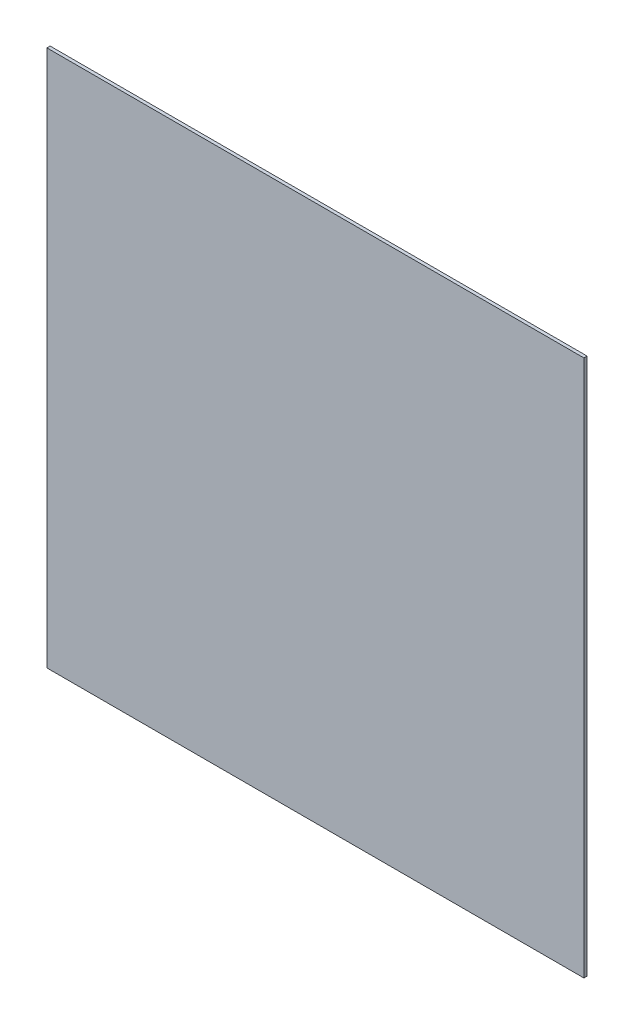
ISO-10303-21;
HEADER;
FILE_DESCRIPTION(('STEP AP214'),'2;1');
FILE_NAME('part.step','',(''),(''),'','','');
FILE_SCHEMA(('AUTOMOTIVE_DESIGN { 1 0 10303 214 1 1 1 1 }'));
ENDSEC;
DATA;
#1=APPLICATION_CONTEXT('core data for automotive mechanical design processes');
#2=APPLICATION_PROTOCOL_DEFINITION('international standard','automotive_design',2000,#1);
#3=PRODUCT_CONTEXT('',#1,'mechanical');
#4=PRODUCT('Part','Part','',(#3));
#5=PRODUCT_RELATED_PRODUCT_CATEGORY('part','',(#4));
#6=PRODUCT_DEFINITION_FORMATION('','',#4);
#7=PRODUCT_DEFINITION_CONTEXT('part definition',#1,'design');
#8=PRODUCT_DEFINITION('design','',#6,#7);
#9=PRODUCT_DEFINITION_SHAPE('','',#8);
#10=(LENGTH_UNIT() NAMED_UNIT(*) SI_UNIT(.MILLI.,.METRE.));
#11=(NAMED_UNIT(*) PLANE_ANGLE_UNIT() SI_UNIT($,.RADIAN.));
#12=(NAMED_UNIT(*) SI_UNIT($,.STERADIAN.) SOLID_ANGLE_UNIT());
#13=UNCERTAINTY_MEASURE_WITH_UNIT(LENGTH_MEASURE(1.E-05),#10,'distance_accuracy_value','');
#14=(GEOMETRIC_REPRESENTATION_CONTEXT(3) GLOBAL_UNCERTAINTY_ASSIGNED_CONTEXT((#13)) GLOBAL_UNIT_ASSIGNED_CONTEXT((#10,
#11,#12)) REPRESENTATION_CONTEXT('',''));
#15=CARTESIAN_POINT('',(0.,0.,0.));
#16=DIRECTION('',(0.,0.,1.));
#17=DIRECTION('',(1.,0.,0.));
#18=AXIS2_PLACEMENT_3D('',#15,#16,#17);
#19=CARTESIAN_POINT('',(500.,500.,3.));
#20=DIRECTION('',(-1.,0.,0.));
#21=DIRECTION('',(0.,-1.,0.));
#22=AXIS2_PLACEMENT_3D('',#19,#20,#21);
#23=PLANE('',#22);
#24=DIRECTION('',(0.,1.,0.));
#25=VECTOR('',#24,1.);
#26=CARTESIAN_POINT('',(500.,500.,-3.));
#27=LINE('',#26,#25);
#28=CARTESIAN_POINT('',(500.,-500.,-3.));
#29=VERTEX_POINT('',#28);
#30=CARTESIAN_POINT('',(500.,500.,-3.));
#31=VERTEX_POINT('',#30);
#32=EDGE_CURVE('E96',#29,#31,#27,.T.);
#33=ORIENTED_EDGE('',*,*,#32,.T.);
#34=DIRECTION('',(0.,0.,-1.));
#35=VECTOR('',#34,1.);
#36=CARTESIAN_POINT('',(500.,500.,3.));
#37=LINE('',#36,#35);
#38=CARTESIAN_POINT('',(500.,500.,3.));
#39=VERTEX_POINT('',#38);
#40=EDGE_CURVE('E11',#39,#31,#37,.T.);
#41=ORIENTED_EDGE('',*,*,#40,.F.);
#42=DIRECTION('',(0.,1.,0.));
#43=VECTOR('',#42,1.);
#44=CARTESIAN_POINT('',(500.,500.,3.));
#45=LINE('',#44,#43);
#46=CARTESIAN_POINT('',(500.,-500.,3.));
#47=VERTEX_POINT('',#46);
#48=EDGE_CURVE('E84',#47,#39,#45,.T.);
#49=ORIENTED_EDGE('',*,*,#48,.F.);
#50=DIRECTION('',(0.,0.,-1.));
#51=VECTOR('',#50,1.);
#52=CARTESIAN_POINT('',(500.,-500.,3.));
#53=LINE('',#52,#51);
#54=EDGE_CURVE('E92',#47,#29,#53,.T.);
#55=ORIENTED_EDGE('',*,*,#54,.T.);
#56=EDGE_LOOP('',(#33,#41,#49,#55));
#57=FACE_BOUND('',#56,.T.);
#58=ADVANCED_FACE('F33',(#57),#23,.F.);
#59=CARTESIAN_POINT('',(-500.,500.,3.));
#60=DIRECTION('',(0.,-1.,0.));
#61=DIRECTION('',(0.,0.,-1.));
#62=AXIS2_PLACEMENT_3D('',#59,#60,#61);
#63=PLANE('',#62);
#64=DIRECTION('',(-1.,0.,0.));
#65=VECTOR('',#64,1.);
#66=CARTESIAN_POINT('',(-500.,500.,-3.));
#67=LINE('',#66,#65);
#68=CARTESIAN_POINT('',(-500.,500.,-3.));
#69=VERTEX_POINT('',#68);
#70=EDGE_CURVE('E88',#31,#69,#67,.T.);
#71=ORIENTED_EDGE('',*,*,#70,.T.);
#72=DIRECTION('',(0.,0.,-1.));
#73=VECTOR('',#72,1.);
#74=CARTESIAN_POINT('',(-500.,500.,3.));
#75=LINE('',#74,#73);
#76=CARTESIAN_POINT('',(-500.,500.,3.));
#77=VERTEX_POINT('',#76);
#78=EDGE_CURVE('E41',#77,#69,#75,.T.);
#79=ORIENTED_EDGE('',*,*,#78,.F.);
#80=DIRECTION('',(-1.,0.,0.));
#81=VECTOR('',#80,1.);
#82=CARTESIAN_POINT('',(-500.,500.,3.));
#83=LINE('',#82,#81);
#84=EDGE_CURVE('E79',#39,#77,#83,.T.);
#85=ORIENTED_EDGE('',*,*,#84,.F.);
#86=ORIENTED_EDGE('',*,*,#40,.T.);
#87=EDGE_LOOP('',(#71,#79,#85,#86));
#88=FACE_BOUND('',#87,.T.);
#89=ADVANCED_FACE('F87',(#88),#63,.F.);
#90=CARTESIAN_POINT('',(-500.,500.,3.));
#91=DIRECTION('',(1.,0.,0.));
#92=DIRECTION('',(0.,0.,-1.));
#93=AXIS2_PLACEMENT_3D('',#90,#91,#92);
#94=PLANE('',#93);
#95=DIRECTION('',(0.,-1.,0.));
#96=VECTOR('',#95,1.);
#97=CARTESIAN_POINT('',(-500.,500.,-3.));
#98=LINE('',#97,#96);
#99=CARTESIAN_POINT('',(-500.,-500.,-3.));
#100=VERTEX_POINT('',#99);
#101=EDGE_CURVE('E66',#69,#100,#98,.T.);
#102=ORIENTED_EDGE('',*,*,#101,.T.);
#103=DIRECTION('',(0.,0.,-1.));
#104=VECTOR('',#103,1.);
#105=CARTESIAN_POINT('',(-500.,-500.,3.));
#106=LINE('',#105,#104);
#107=CARTESIAN_POINT('',(-500.,-500.,3.));
#108=VERTEX_POINT('',#107);
#109=EDGE_CURVE('E89',#108,#100,#106,.T.);
#110=ORIENTED_EDGE('',*,*,#109,.F.);
#111=DIRECTION('',(0.,-1.,0.));
#112=VECTOR('',#111,1.);
#113=CARTESIAN_POINT('',(-500.,500.,3.));
#114=LINE('',#113,#112);
#115=EDGE_CURVE('E82',#77,#108,#114,.T.);
#116=ORIENTED_EDGE('',*,*,#115,.F.);
#117=ORIENTED_EDGE('',*,*,#78,.T.);
#118=EDGE_LOOP('',(#102,#110,#116,#117));
#119=FACE_BOUND('',#118,.T.);
#120=ADVANCED_FACE('F90',(#119),#94,.F.);
#121=CARTESIAN_POINT('',(-500.,-500.,3.));
#122=DIRECTION('',(0.,1.,0.));
#123=DIRECTION('',(0.,0.,1.));
#124=AXIS2_PLACEMENT_3D('',#121,#122,#123);
#125=PLANE('',#124);
#126=DIRECTION('',(1.,0.,0.));
#127=VECTOR('',#126,1.);
#128=CARTESIAN_POINT('',(-500.,-500.,-3.));
#129=LINE('',#128,#127);
#130=EDGE_CURVE('E72',#100,#29,#129,.T.);
#131=ORIENTED_EDGE('',*,*,#130,.T.);
#132=ORIENTED_EDGE('',*,*,#54,.F.);
#133=DIRECTION('',(1.,0.,0.));
#134=VECTOR('',#133,1.);
#135=CARTESIAN_POINT('',(-500.,-500.,3.));
#136=LINE('',#135,#134);
#137=EDGE_CURVE('E49',#108,#47,#136,.T.);
#138=ORIENTED_EDGE('',*,*,#137,.F.);
#139=ORIENTED_EDGE('',*,*,#109,.T.);
#140=EDGE_LOOP('',(#131,#132,#138,#139));
#141=FACE_BOUND('',#140,.T.);
#142=ADVANCED_FACE('F103',(#141),#125,.F.);
#143=CARTESIAN_POINT('',(0.,0.,3.));
#144=DIRECTION('',(0.,0.,1.));
#145=DIRECTION('',(1.,0.,0.));
#146=AXIS2_PLACEMENT_3D('',#143,#144,#145);
#147=PLANE('',#146);
#148=ORIENTED_EDGE('',*,*,#48,.T.);
#149=ORIENTED_EDGE('',*,*,#84,.T.);
#150=ORIENTED_EDGE('',*,*,#115,.T.);
#151=ORIENTED_EDGE('',*,*,#137,.T.);
#152=EDGE_LOOP('',(#148,#149,#150,#151));
#153=FACE_BOUND('',#152,.T.);
#154=ADVANCED_FACE('F80',(#153),#147,.T.);
#155=CARTESIAN_POINT('',(0.,0.,-3.));
#156=DIRECTION('',(0.,0.,1.));
#157=DIRECTION('',(1.,0.,0.));
#158=AXIS2_PLACEMENT_3D('',#155,#156,#157);
#159=PLANE('',#158);
#160=ORIENTED_EDGE('',*,*,#32,.F.);
#161=ORIENTED_EDGE('',*,*,#130,.F.);
#162=ORIENTED_EDGE('',*,*,#101,.F.);
#163=ORIENTED_EDGE('',*,*,#70,.F.);
#164=EDGE_LOOP('',(#160,#161,#162,#163));
#165=FACE_BOUND('',#164,.T.);
#166=ADVANCED_FACE('F106',(#165),#159,.F.);
#167=CLOSED_SHELL('',(#58,#89,#120,#142,#154,#166));
#168=MANIFOLD_SOLID_BREP('B2',#167);
#169=ADVANCED_BREP_SHAPE_REPRESENTATION('',(#18,#168),#14);
#170=SHAPE_DEFINITION_REPRESENTATION(#9,#169);
ENDSEC;
END-ISO-10303-21;
